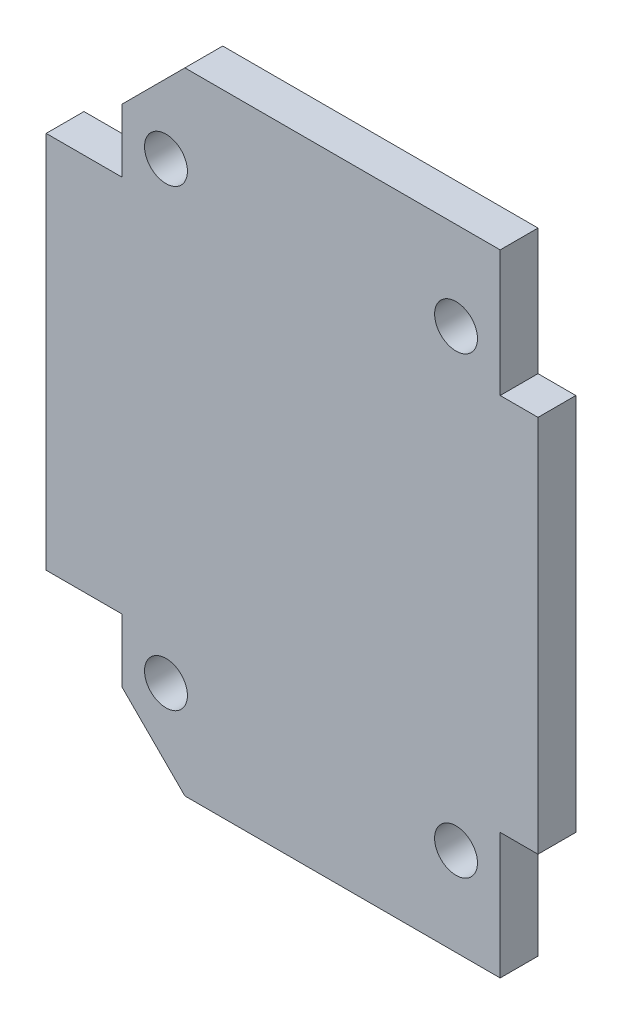
ISO-10303-21;
HEADER;
FILE_DESCRIPTION(('STEP AP214'),'2;1');
FILE_NAME('part.step','',(''),(''),'','','');
FILE_SCHEMA(('AUTOMOTIVE_DESIGN { 1 0 10303 214 1 1 1 1 }'));
ENDSEC;
DATA;
#1=APPLICATION_CONTEXT('core data for automotive mechanical design processes');
#2=APPLICATION_PROTOCOL_DEFINITION('international standard','automotive_design',2000,#1);
#3=PRODUCT_CONTEXT('',#1,'mechanical');
#4=PRODUCT('Part','Part','',(#3));
#5=PRODUCT_RELATED_PRODUCT_CATEGORY('part','',(#4));
#6=PRODUCT_DEFINITION_FORMATION('','',#4);
#7=PRODUCT_DEFINITION_CONTEXT('part definition',#1,'design');
#8=PRODUCT_DEFINITION('design','',#6,#7);
#9=PRODUCT_DEFINITION_SHAPE('','',#8);
#10=(LENGTH_UNIT() NAMED_UNIT(*) SI_UNIT(.MILLI.,.METRE.));
#11=(NAMED_UNIT(*) PLANE_ANGLE_UNIT() SI_UNIT($,.RADIAN.));
#12=(NAMED_UNIT(*) SI_UNIT($,.STERADIAN.) SOLID_ANGLE_UNIT());
#13=UNCERTAINTY_MEASURE_WITH_UNIT(LENGTH_MEASURE(1.E-05),#10,'distance_accuracy_value','');
#14=(GEOMETRIC_REPRESENTATION_CONTEXT(3) GLOBAL_UNCERTAINTY_ASSIGNED_CONTEXT((#13)) GLOBAL_UNIT_ASSIGNED_CONTEXT((#10,
#11,#12)) REPRESENTATION_CONTEXT('',''));
#15=CARTESIAN_POINT('',(0.,0.,0.));
#16=DIRECTION('',(0.,0.,1.));
#17=DIRECTION('',(1.,0.,0.));
#18=AXIS2_PLACEMENT_3D('',#15,#16,#17);
#19=CARTESIAN_POINT('',(0.,0.,3.));
#20=DIRECTION('',(0.,0.,-1.));
#21=DIRECTION('',(-1.,0.,0.));
#22=AXIS2_PLACEMENT_3D('',#19,#20,#21);
#23=PLANE('',#22);
#24=DIRECTION('',(0.,-1.,0.));
#25=VECTOR('',#24,1.);
#26=CARTESIAN_POINT('',(-15.,-25.,3.));
#27=LINE('',#26,#25);
#28=CARTESIAN_POINT('',(-15.,-15.,3.));
#29=VERTEX_POINT('',#28);
#30=CARTESIAN_POINT('',(-15.,-20.,3.));
#31=VERTEX_POINT('',#30);
#32=EDGE_CURVE('E285',#29,#31,#27,.T.);
#33=ORIENTED_EDGE('',*,*,#32,.T.);
#34=DIRECTION('',(-0.707106781186547,0.707106781186548,0.));
#35=VECTOR('',#34,1.);
#36=CARTESIAN_POINT('',(-9.99999999999999,-25.,3.));
#37=LINE('',#36,#35);
#38=CARTESIAN_POINT('',(-9.99999999999999,-25.,3.));
#39=VERTEX_POINT('',#38);
#40=EDGE_CURVE('E188',#31,#39,#37,.F.);
#41=ORIENTED_EDGE('',*,*,#40,.T.);
#42=DIRECTION('',(1.,0.,0.));
#43=VECTOR('',#42,1.);
#44=CARTESIAN_POINT('',(-15.,-25.,3.));
#45=LINE('',#44,#43);
#46=CARTESIAN_POINT('',(15.,-25.,3.));
#47=VERTEX_POINT('',#46);
#48=EDGE_CURVE('E288',#39,#47,#45,.T.);
#49=ORIENTED_EDGE('',*,*,#48,.T.);
#50=DIRECTION('',(0.,1.,0.));
#51=VECTOR('',#50,1.);
#52=CARTESIAN_POINT('',(15.,-25.,3.));
#53=LINE('',#52,#51);
#54=CARTESIAN_POINT('',(15.,-15.,3.));
#55=VERTEX_POINT('',#54);
#56=EDGE_CURVE('E293',#47,#55,#53,.T.);
#57=ORIENTED_EDGE('',*,*,#56,.T.);
#58=DIRECTION('',(1.,0.,0.));
#59=VECTOR('',#58,1.);
#60=CARTESIAN_POINT('',(15.,-15.,3.));
#61=LINE('',#60,#59);
#62=CARTESIAN_POINT('',(18.,-15.,3.));
#63=VERTEX_POINT('',#62);
#64=EDGE_CURVE('E300',#55,#63,#61,.T.);
#65=ORIENTED_EDGE('',*,*,#64,.T.);
#66=DIRECTION('',(0.,1.,0.));
#67=VECTOR('',#66,1.);
#68=CARTESIAN_POINT('',(18.,-15.,3.));
#69=LINE('',#68,#67);
#70=CARTESIAN_POINT('',(18.,15.,3.));
#71=VERTEX_POINT('',#70);
#72=EDGE_CURVE('E303',#63,#71,#69,.T.);
#73=ORIENTED_EDGE('',*,*,#72,.T.);
#74=DIRECTION('',(-1.,0.,0.));
#75=VECTOR('',#74,1.);
#76=CARTESIAN_POINT('',(15.,15.,3.));
#77=LINE('',#76,#75);
#78=CARTESIAN_POINT('',(15.,15.,3.));
#79=VERTEX_POINT('',#78);
#80=EDGE_CURVE('E154',#71,#79,#77,.T.);
#81=ORIENTED_EDGE('',*,*,#80,.T.);
#82=DIRECTION('',(0.,1.,0.));
#83=VECTOR('',#82,1.);
#84=CARTESIAN_POINT('',(15.,15.,3.));
#85=LINE('',#84,#83);
#86=CARTESIAN_POINT('',(15.,25.,3.));
#87=VERTEX_POINT('',#86);
#88=EDGE_CURVE('E148',#79,#87,#85,.T.);
#89=ORIENTED_EDGE('',*,*,#88,.T.);
#90=DIRECTION('',(-1.,0.,0.));
#91=VECTOR('',#90,1.);
#92=CARTESIAN_POINT('',(-15.,25.,3.));
#93=LINE('',#92,#91);
#94=CARTESIAN_POINT('',(-10.,25.,3.));
#95=VERTEX_POINT('',#94);
#96=EDGE_CURVE('E140',#87,#95,#93,.T.);
#97=ORIENTED_EDGE('',*,*,#96,.T.);
#98=DIRECTION('',(0.707106781186549,0.707106781186547,0.));
#99=VECTOR('',#98,1.);
#100=CARTESIAN_POINT('',(-15.,20.,3.));
#101=LINE('',#100,#99);
#102=CARTESIAN_POINT('',(-15.,20.,3.));
#103=VERTEX_POINT('',#102);
#104=EDGE_CURVE('E57',#95,#103,#101,.F.);
#105=ORIENTED_EDGE('',*,*,#104,.T.);
#106=DIRECTION('',(0.,-1.,0.));
#107=VECTOR('',#106,1.);
#108=CARTESIAN_POINT('',(-15.,15.,3.));
#109=LINE('',#108,#107);
#110=CARTESIAN_POINT('',(-15.,15.,3.));
#111=VERTEX_POINT('',#110);
#112=EDGE_CURVE('E147',#103,#111,#109,.T.);
#113=ORIENTED_EDGE('',*,*,#112,.T.);
#114=DIRECTION('',(-1.,0.,0.));
#115=VECTOR('',#114,1.);
#116=CARTESIAN_POINT('',(-15.,15.,3.));
#117=LINE('',#116,#115);
#118=CARTESIAN_POINT('',(-21.,15.,3.));
#119=VERTEX_POINT('',#118);
#120=EDGE_CURVE('E325',#111,#119,#117,.T.);
#121=ORIENTED_EDGE('',*,*,#120,.T.);
#122=DIRECTION('',(0.,-1.,0.));
#123=VECTOR('',#122,1.);
#124=CARTESIAN_POINT('',(-21.,-15.,3.));
#125=LINE('',#124,#123);
#126=CARTESIAN_POINT('',(-21.,-15.,3.));
#127=VERTEX_POINT('',#126);
#128=EDGE_CURVE('E272',#119,#127,#125,.T.);
#129=ORIENTED_EDGE('',*,*,#128,.T.);
#130=DIRECTION('',(1.,0.,0.));
#131=VECTOR('',#130,1.);
#132=CARTESIAN_POINT('',(-15.,-15.,3.));
#133=LINE('',#132,#131);
#134=EDGE_CURVE('E289',#127,#29,#133,.T.);
#135=ORIENTED_EDGE('',*,*,#134,.T.);
#136=EDGE_LOOP('',(#33,#41,#49,#57,#65,#73,#81,#89,#97,#105,#113,#121,#129,#135));
#137=FACE_BOUND('',#136,.T.);
#138=CARTESIAN_POINT('',(11.5,-18.,3.));
#139=DIRECTION('',(0.,0.,1.));
#140=DIRECTION('',(1.,0.,0.));
#141=AXIS2_PLACEMENT_3D('',#138,#139,#140);
#142=CIRCLE('',#141,1.7);
#143=CARTESIAN_POINT('',(13.2,-18.,3.));
#144=VERTEX_POINT('',#143);
#145=EDGE_CURVE('E308',#144,#144,#142,.T.);
#146=ORIENTED_EDGE('',*,*,#145,.F.);
#147=EDGE_LOOP('',(#146));
#148=FACE_BOUND('',#147,.T.);
#149=CARTESIAN_POINT('',(11.5,18.,3.));
#150=DIRECTION('',(0.,0.,1.));
#151=DIRECTION('',(1.,0.,0.));
#152=AXIS2_PLACEMENT_3D('',#149,#150,#151);
#153=CIRCLE('',#152,1.7);
#154=CARTESIAN_POINT('',(13.2,18.,3.));
#155=VERTEX_POINT('',#154);
#156=EDGE_CURVE('E317',#155,#155,#153,.T.);
#157=ORIENTED_EDGE('',*,*,#156,.F.);
#158=EDGE_LOOP('',(#157));
#159=FACE_BOUND('',#158,.T.);
#160=CARTESIAN_POINT('',(-11.5,18.,3.));
#161=DIRECTION('',(0.,0.,1.));
#162=DIRECTION('',(1.,0.,0.));
#163=AXIS2_PLACEMENT_3D('',#160,#161,#162);
#164=CIRCLE('',#163,1.7);
#165=CARTESIAN_POINT('',(-9.8,18.,3.));
#166=VERTEX_POINT('',#165);
#167=EDGE_CURVE('E534',#166,#166,#164,.T.);
#168=ORIENTED_EDGE('',*,*,#167,.F.);
#169=EDGE_LOOP('',(#168));
#170=FACE_BOUND('',#169,.T.);
#171=CARTESIAN_POINT('',(-11.5,-18.,3.));
#172=DIRECTION('',(0.,0.,1.));
#173=DIRECTION('',(1.,0.,0.));
#174=AXIS2_PLACEMENT_3D('',#171,#172,#173);
#175=CIRCLE('',#174,1.7);
#176=CARTESIAN_POINT('',(-9.8,-18.,3.));
#177=VERTEX_POINT('',#176);
#178=EDGE_CURVE('E523',#177,#177,#175,.T.);
#179=ORIENTED_EDGE('',*,*,#178,.F.);
#180=EDGE_LOOP('',(#179));
#181=FACE_BOUND('',#180,.T.);
#182=ADVANCED_FACE('F41',(#137,#148,#159,#170,#181),#23,.F.);
#183=CARTESIAN_POINT('',(0.,0.,0.));
#184=DIRECTION('',(0.,0.,-1.));
#185=DIRECTION('',(-1.,0.,0.));
#186=AXIS2_PLACEMENT_3D('',#183,#184,#185);
#187=PLANE('',#186);
#188=CARTESIAN_POINT('',(-11.5,18.,0.));
#189=DIRECTION('',(0.,0.,1.));
#190=DIRECTION('',(1.,0.,0.));
#191=AXIS2_PLACEMENT_3D('',#188,#189,#190);
#192=CIRCLE('',#191,1.7);
#193=CARTESIAN_POINT('',(-9.8,18.,0.));
#194=VERTEX_POINT('',#193);
#195=EDGE_CURVE('E531',#194,#194,#192,.T.);
#196=ORIENTED_EDGE('',*,*,#195,.T.);
#197=EDGE_LOOP('',(#196));
#198=FACE_BOUND('',#197,.T.);
#199=CARTESIAN_POINT('',(11.5,-18.,0.));
#200=DIRECTION('',(0.,0.,1.));
#201=DIRECTION('',(1.,0.,0.));
#202=AXIS2_PLACEMENT_3D('',#199,#200,#201);
#203=CIRCLE('',#202,1.7);
#204=CARTESIAN_POINT('',(13.2,-18.,0.));
#205=VERTEX_POINT('',#204);
#206=EDGE_CURVE('E311',#205,#205,#203,.T.);
#207=ORIENTED_EDGE('',*,*,#206,.T.);
#208=EDGE_LOOP('',(#207));
#209=FACE_BOUND('',#208,.T.);
#210=DIRECTION('',(1.,0.,0.));
#211=VECTOR('',#210,1.);
#212=CARTESIAN_POINT('',(-15.,-25.,0.));
#213=LINE('',#212,#211);
#214=CARTESIAN_POINT('',(-9.99999999999999,-25.,0.));
#215=VERTEX_POINT('',#214);
#216=CARTESIAN_POINT('',(15.,-25.,0.));
#217=VERTEX_POINT('',#216);
#218=EDGE_CURVE('E225',#215,#217,#213,.T.);
#219=ORIENTED_EDGE('',*,*,#218,.F.);
#220=DIRECTION('',(0.707106781186547,-0.707106781186548,0.));
#221=VECTOR('',#220,1.);
#222=CARTESIAN_POINT('',(-17.5,-17.5,0.));
#223=LINE('',#222,#221);
#224=CARTESIAN_POINT('',(-15.,-20.,0.));
#225=VERTEX_POINT('',#224);
#226=EDGE_CURVE('E180',#215,#225,#223,.F.);
#227=ORIENTED_EDGE('',*,*,#226,.T.);
#228=DIRECTION('',(0.,-1.,0.));
#229=VECTOR('',#228,1.);
#230=CARTESIAN_POINT('',(-15.,-25.,0.));
#231=LINE('',#230,#229);
#232=CARTESIAN_POINT('',(-15.,-15.,0.));
#233=VERTEX_POINT('',#232);
#234=EDGE_CURVE('E221',#233,#225,#231,.T.);
#235=ORIENTED_EDGE('',*,*,#234,.F.);
#236=DIRECTION('',(1.,0.,0.));
#237=VECTOR('',#236,1.);
#238=CARTESIAN_POINT('',(-15.,-15.,0.));
#239=LINE('',#238,#237);
#240=CARTESIAN_POINT('',(-21.,-15.,0.));
#241=VERTEX_POINT('',#240);
#242=EDGE_CURVE('E218',#241,#233,#239,.T.);
#243=ORIENTED_EDGE('',*,*,#242,.F.);
#244=DIRECTION('',(0.,-1.,0.));
#245=VECTOR('',#244,1.);
#246=CARTESIAN_POINT('',(-21.,-15.,0.));
#247=LINE('',#246,#245);
#248=CARTESIAN_POINT('',(-21.,15.,0.));
#249=VERTEX_POINT('',#248);
#250=EDGE_CURVE('E211',#249,#241,#247,.T.);
#251=ORIENTED_EDGE('',*,*,#250,.F.);
#252=DIRECTION('',(-1.,0.,0.));
#253=VECTOR('',#252,1.);
#254=CARTESIAN_POINT('',(-15.,15.,0.));
#255=LINE('',#254,#253);
#256=CARTESIAN_POINT('',(-15.,15.,0.));
#257=VERTEX_POINT('',#256);
#258=EDGE_CURVE('E205',#257,#249,#255,.T.);
#259=ORIENTED_EDGE('',*,*,#258,.F.);
#260=DIRECTION('',(0.,-1.,0.));
#261=VECTOR('',#260,1.);
#262=CARTESIAN_POINT('',(-15.,15.,0.));
#263=LINE('',#262,#261);
#264=CARTESIAN_POINT('',(-15.,20.,0.));
#265=VERTEX_POINT('',#264);
#266=EDGE_CURVE('E197',#265,#257,#263,.T.);
#267=ORIENTED_EDGE('',*,*,#266,.F.);
#268=DIRECTION('',(-0.707106781186549,-0.707106781186547,0.));
#269=VECTOR('',#268,1.);
#270=CARTESIAN_POINT('',(-17.5,17.5,0.));
#271=LINE('',#270,#269);
#272=CARTESIAN_POINT('',(-10.,25.,0.));
#273=VERTEX_POINT('',#272);
#274=EDGE_CURVE('E171',#265,#273,#271,.F.);
#275=ORIENTED_EDGE('',*,*,#274,.T.);
#276=DIRECTION('',(-1.,0.,0.));
#277=VECTOR('',#276,1.);
#278=CARTESIAN_POINT('',(-15.,25.,0.));
#279=LINE('',#278,#277);
#280=CARTESIAN_POINT('',(15.,25.,0.));
#281=VERTEX_POINT('',#280);
#282=EDGE_CURVE('E207',#281,#273,#279,.T.);
#283=ORIENTED_EDGE('',*,*,#282,.F.);
#284=DIRECTION('',(0.,1.,0.));
#285=VECTOR('',#284,1.);
#286=CARTESIAN_POINT('',(15.,15.,0.));
#287=LINE('',#286,#285);
#288=CARTESIAN_POINT('',(15.,15.,0.));
#289=VERTEX_POINT('',#288);
#290=EDGE_CURVE('E163',#289,#281,#287,.T.);
#291=ORIENTED_EDGE('',*,*,#290,.F.);
#292=DIRECTION('',(-1.,0.,0.));
#293=VECTOR('',#292,1.);
#294=CARTESIAN_POINT('',(15.,15.,0.));
#295=LINE('',#294,#293);
#296=CARTESIAN_POINT('',(18.,15.,0.));
#297=VERTEX_POINT('',#296);
#298=EDGE_CURVE('E159',#297,#289,#295,.T.);
#299=ORIENTED_EDGE('',*,*,#298,.F.);
#300=DIRECTION('',(0.,1.,0.));
#301=VECTOR('',#300,1.);
#302=CARTESIAN_POINT('',(18.,-15.,0.));
#303=LINE('',#302,#301);
#304=CARTESIAN_POINT('',(18.,-15.,0.));
#305=VERTEX_POINT('',#304);
#306=EDGE_CURVE('E234',#305,#297,#303,.T.);
#307=ORIENTED_EDGE('',*,*,#306,.F.);
#308=DIRECTION('',(1.,0.,0.));
#309=VECTOR('',#308,1.);
#310=CARTESIAN_POINT('',(15.,-15.,0.));
#311=LINE('',#310,#309);
#312=CARTESIAN_POINT('',(15.,-15.,0.));
#313=VERTEX_POINT('',#312);
#314=EDGE_CURVE('E231',#313,#305,#311,.T.);
#315=ORIENTED_EDGE('',*,*,#314,.F.);
#316=DIRECTION('',(0.,1.,0.));
#317=VECTOR('',#316,1.);
#318=CARTESIAN_POINT('',(15.,-25.,0.));
#319=LINE('',#318,#317);
#320=EDGE_CURVE('E228',#217,#313,#319,.T.);
#321=ORIENTED_EDGE('',*,*,#320,.F.);
#322=EDGE_LOOP('',(#219,#227,#235,#243,#251,#259,#267,#275,#283,#291,#299,#307,#315,#321));
#323=FACE_BOUND('',#322,.T.);
#324=CARTESIAN_POINT('',(11.5,18.,0.));
#325=DIRECTION('',(0.,0.,1.));
#326=DIRECTION('',(1.,0.,0.));
#327=AXIS2_PLACEMENT_3D('',#324,#325,#326);
#328=CIRCLE('',#327,1.7);
#329=CARTESIAN_POINT('',(13.2,18.,0.));
#330=VERTEX_POINT('',#329);
#331=EDGE_CURVE('E320',#330,#330,#328,.T.);
#332=ORIENTED_EDGE('',*,*,#331,.T.);
#333=EDGE_LOOP('',(#332));
#334=FACE_BOUND('',#333,.T.);
#335=CARTESIAN_POINT('',(-11.5,-18.,0.));
#336=DIRECTION('',(0.,0.,1.));
#337=DIRECTION('',(1.,0.,0.));
#338=AXIS2_PLACEMENT_3D('',#335,#336,#337);
#339=CIRCLE('',#338,1.7);
#340=CARTESIAN_POINT('',(-9.8,-18.,0.));
#341=VERTEX_POINT('',#340);
#342=EDGE_CURVE('E526',#341,#341,#339,.T.);
#343=ORIENTED_EDGE('',*,*,#342,.T.);
#344=EDGE_LOOP('',(#343));
#345=FACE_BOUND('',#344,.T.);
#346=ADVANCED_FACE('F202',(#198,#209,#323,#334,#345),#187,.T.);
#347=CARTESIAN_POINT('',(15.,15.,3.));
#348=DIRECTION('',(-1.,0.,0.));
#349=DIRECTION('',(0.,0.,1.));
#350=AXIS2_PLACEMENT_3D('',#347,#348,#349);
#351=PLANE('',#350);
#352=ORIENTED_EDGE('',*,*,#290,.T.);
#353=DIRECTION('',(0.,0.,-1.));
#354=VECTOR('',#353,1.);
#355=CARTESIAN_POINT('',(15.,25.,3.));
#356=LINE('',#355,#354);
#357=EDGE_CURVE('E144',#87,#281,#356,.T.);
#358=ORIENTED_EDGE('',*,*,#357,.F.);
#359=ORIENTED_EDGE('',*,*,#88,.F.);
#360=DIRECTION('',(0.,0.,-1.));
#361=VECTOR('',#360,1.);
#362=CARTESIAN_POINT('',(15.,15.,3.));
#363=LINE('',#362,#361);
#364=EDGE_CURVE('E239',#79,#289,#363,.T.);
#365=ORIENTED_EDGE('',*,*,#364,.T.);
#366=EDGE_LOOP('',(#352,#358,#359,#365));
#367=FACE_BOUND('',#366,.T.);
#368=ADVANCED_FACE('F161',(#367),#351,.F.);
#369=CARTESIAN_POINT('',(-15.,25.,3.));
#370=DIRECTION('',(0.,-1.,0.));
#371=DIRECTION('',(1.,0.,0.));
#372=AXIS2_PLACEMENT_3D('',#369,#370,#371);
#373=PLANE('',#372);
#374=ORIENTED_EDGE('',*,*,#282,.T.);
#375=DIRECTION('',(0.,0.,1.));
#376=VECTOR('',#375,1.);
#377=CARTESIAN_POINT('',(-10.,25.,3.));
#378=LINE('',#377,#376);
#379=EDGE_CURVE('E11',#273,#95,#378,.T.);
#380=ORIENTED_EDGE('',*,*,#379,.T.);
#381=ORIENTED_EDGE('',*,*,#96,.F.);
#382=ORIENTED_EDGE('',*,*,#357,.T.);
#383=EDGE_LOOP('',(#374,#380,#381,#382));
#384=FACE_BOUND('',#383,.T.);
#385=ADVANCED_FACE('F142',(#384),#373,.F.);
#386=CARTESIAN_POINT('',(-15.,15.,3.));
#387=DIRECTION('',(1.,0.,0.));
#388=DIRECTION('',(0.,1.,0.));
#389=AXIS2_PLACEMENT_3D('',#386,#387,#388);
#390=PLANE('',#389);
#391=ORIENTED_EDGE('',*,*,#112,.F.);
#392=DIRECTION('',(0.,0.,-1.));
#393=VECTOR('',#392,1.);
#394=CARTESIAN_POINT('',(-15.,20.,3.));
#395=LINE('',#394,#393);
#396=EDGE_CURVE('E50',#103,#265,#395,.T.);
#397=ORIENTED_EDGE('',*,*,#396,.T.);
#398=ORIENTED_EDGE('',*,*,#266,.T.);
#399=DIRECTION('',(0.,0.,-1.));
#400=VECTOR('',#399,1.);
#401=CARTESIAN_POINT('',(-15.,15.,3.));
#402=LINE('',#401,#400);
#403=EDGE_CURVE('E166',#111,#257,#402,.T.);
#404=ORIENTED_EDGE('',*,*,#403,.F.);
#405=EDGE_LOOP('',(#391,#397,#398,#404));
#406=FACE_BOUND('',#405,.T.);
#407=ADVANCED_FACE('F195',(#406),#390,.F.);
#408=CARTESIAN_POINT('',(-15.,15.,3.));
#409=DIRECTION('',(0.,-1.,0.));
#410=DIRECTION('',(1.,0.,0.));
#411=AXIS2_PLACEMENT_3D('',#408,#409,#410);
#412=PLANE('',#411);
#413=ORIENTED_EDGE('',*,*,#258,.T.);
#414=DIRECTION('',(0.,0.,-1.));
#415=VECTOR('',#414,1.);
#416=CARTESIAN_POINT('',(-21.,15.,3.));
#417=LINE('',#416,#415);
#418=EDGE_CURVE('E174',#119,#249,#417,.T.);
#419=ORIENTED_EDGE('',*,*,#418,.F.);
#420=ORIENTED_EDGE('',*,*,#120,.F.);
#421=ORIENTED_EDGE('',*,*,#403,.T.);
#422=EDGE_LOOP('',(#413,#419,#420,#421));
#423=FACE_BOUND('',#422,.T.);
#424=ADVANCED_FACE('F328',(#423),#412,.F.);
#425=CARTESIAN_POINT('',(-21.,-15.,3.));
#426=DIRECTION('',(1.,0.,0.));
#427=DIRECTION('',(0.,1.,0.));
#428=AXIS2_PLACEMENT_3D('',#425,#426,#427);
#429=PLANE('',#428);
#430=ORIENTED_EDGE('',*,*,#250,.T.);
#431=DIRECTION('',(0.,0.,-1.));
#432=VECTOR('',#431,1.);
#433=CARTESIAN_POINT('',(-21.,-15.,3.));
#434=LINE('',#433,#432);
#435=EDGE_CURVE('E262',#127,#241,#434,.T.);
#436=ORIENTED_EDGE('',*,*,#435,.F.);
#437=ORIENTED_EDGE('',*,*,#128,.F.);
#438=ORIENTED_EDGE('',*,*,#418,.T.);
#439=EDGE_LOOP('',(#430,#436,#437,#438));
#440=FACE_BOUND('',#439,.T.);
#441=ADVANCED_FACE('F270',(#440),#429,.F.);
#442=CARTESIAN_POINT('',(-15.,-15.,3.));
#443=DIRECTION('',(0.,1.,0.));
#444=DIRECTION('',(-1.,0.,0.));
#445=AXIS2_PLACEMENT_3D('',#442,#443,#444);
#446=PLANE('',#445);
#447=ORIENTED_EDGE('',*,*,#242,.T.);
#448=DIRECTION('',(0.,0.,-1.));
#449=VECTOR('',#448,1.);
#450=CARTESIAN_POINT('',(-15.,-15.,3.));
#451=LINE('',#450,#449);
#452=EDGE_CURVE('E258',#29,#233,#451,.T.);
#453=ORIENTED_EDGE('',*,*,#452,.F.);
#454=ORIENTED_EDGE('',*,*,#134,.F.);
#455=ORIENTED_EDGE('',*,*,#435,.T.);
#456=EDGE_LOOP('',(#447,#453,#454,#455));
#457=FACE_BOUND('',#456,.T.);
#458=ADVANCED_FACE('F279',(#457),#446,.F.);
#459=CARTESIAN_POINT('',(-15.,-25.,3.));
#460=DIRECTION('',(1.,0.,0.));
#461=DIRECTION('',(0.,0.,-1.));
#462=AXIS2_PLACEMENT_3D('',#459,#460,#461);
#463=PLANE('',#462);
#464=ORIENTED_EDGE('',*,*,#234,.T.);
#465=DIRECTION('',(0.,0.,1.));
#466=VECTOR('',#465,1.);
#467=CARTESIAN_POINT('',(-15.,-20.,3.));
#468=LINE('',#467,#466);
#469=EDGE_CURVE('E183',#225,#31,#468,.T.);
#470=ORIENTED_EDGE('',*,*,#469,.T.);
#471=ORIENTED_EDGE('',*,*,#32,.F.);
#472=ORIENTED_EDGE('',*,*,#452,.T.);
#473=EDGE_LOOP('',(#464,#470,#471,#472));
#474=FACE_BOUND('',#473,.T.);
#475=ADVANCED_FACE('F283',(#474),#463,.F.);
#476=CARTESIAN_POINT('',(-15.,-25.,3.));
#477=DIRECTION('',(0.,1.,0.));
#478=DIRECTION('',(-1.,0.,0.));
#479=AXIS2_PLACEMENT_3D('',#476,#477,#478);
#480=PLANE('',#479);
#481=ORIENTED_EDGE('',*,*,#48,.F.);
#482=DIRECTION('',(0.,0.,-1.));
#483=VECTOR('',#482,1.);
#484=CARTESIAN_POINT('',(-9.99999999999999,-25.,3.));
#485=LINE('',#484,#483);
#486=EDGE_CURVE('E165',#39,#215,#485,.T.);
#487=ORIENTED_EDGE('',*,*,#486,.T.);
#488=ORIENTED_EDGE('',*,*,#218,.T.);
#489=DIRECTION('',(0.,0.,-1.));
#490=VECTOR('',#489,1.);
#491=CARTESIAN_POINT('',(15.,-25.,3.));
#492=LINE('',#491,#490);
#493=EDGE_CURVE('E254',#47,#217,#492,.T.);
#494=ORIENTED_EDGE('',*,*,#493,.F.);
#495=EDGE_LOOP('',(#481,#487,#488,#494));
#496=FACE_BOUND('',#495,.T.);
#497=ADVANCED_FACE('F363',(#496),#480,.F.);
#498=CARTESIAN_POINT('',(15.,-25.,3.));
#499=DIRECTION('',(-1.,0.,0.));
#500=DIRECTION('',(0.,-1.,0.));
#501=AXIS2_PLACEMENT_3D('',#498,#499,#500);
#502=PLANE('',#501);
#503=ORIENTED_EDGE('',*,*,#320,.T.);
#504=DIRECTION('',(0.,0.,-1.));
#505=VECTOR('',#504,1.);
#506=CARTESIAN_POINT('',(15.,-15.,3.));
#507=LINE('',#506,#505);
#508=EDGE_CURVE('E250',#55,#313,#507,.T.);
#509=ORIENTED_EDGE('',*,*,#508,.F.);
#510=ORIENTED_EDGE('',*,*,#56,.F.);
#511=ORIENTED_EDGE('',*,*,#493,.T.);
#512=EDGE_LOOP('',(#503,#509,#510,#511));
#513=FACE_BOUND('',#512,.T.);
#514=ADVANCED_FACE('F359',(#513),#502,.F.);
#515=CARTESIAN_POINT('',(15.,-15.,3.));
#516=DIRECTION('',(0.,1.,0.));
#517=DIRECTION('',(0.,0.,1.));
#518=AXIS2_PLACEMENT_3D('',#515,#516,#517);
#519=PLANE('',#518);
#520=ORIENTED_EDGE('',*,*,#314,.T.);
#521=DIRECTION('',(0.,0.,-1.));
#522=VECTOR('',#521,1.);
#523=CARTESIAN_POINT('',(18.,-15.,3.));
#524=LINE('',#523,#522);
#525=EDGE_CURVE('E246',#63,#305,#524,.T.);
#526=ORIENTED_EDGE('',*,*,#525,.F.);
#527=ORIENTED_EDGE('',*,*,#64,.F.);
#528=ORIENTED_EDGE('',*,*,#508,.T.);
#529=EDGE_LOOP('',(#520,#526,#527,#528));
#530=FACE_BOUND('',#529,.T.);
#531=ADVANCED_FACE('F355',(#530),#519,.F.);
#532=CARTESIAN_POINT('',(18.,-15.,3.));
#533=DIRECTION('',(-1.,0.,0.));
#534=DIRECTION('',(0.,0.,1.));
#535=AXIS2_PLACEMENT_3D('',#532,#533,#534);
#536=PLANE('',#535);
#537=ORIENTED_EDGE('',*,*,#306,.T.);
#538=DIRECTION('',(0.,0.,-1.));
#539=VECTOR('',#538,1.);
#540=CARTESIAN_POINT('',(18.,15.,3.));
#541=LINE('',#540,#539);
#542=EDGE_CURVE('E242',#71,#297,#541,.T.);
#543=ORIENTED_EDGE('',*,*,#542,.F.);
#544=ORIENTED_EDGE('',*,*,#72,.F.);
#545=ORIENTED_EDGE('',*,*,#525,.T.);
#546=EDGE_LOOP('',(#537,#543,#544,#545));
#547=FACE_BOUND('',#546,.T.);
#548=ADVANCED_FACE('F351',(#547),#536,.F.);
#549=CARTESIAN_POINT('',(15.,15.,3.));
#550=DIRECTION('',(0.,-1.,0.));
#551=DIRECTION('',(1.,0.,0.));
#552=AXIS2_PLACEMENT_3D('',#549,#550,#551);
#553=PLANE('',#552);
#554=ORIENTED_EDGE('',*,*,#298,.T.);
#555=ORIENTED_EDGE('',*,*,#364,.F.);
#556=ORIENTED_EDGE('',*,*,#80,.F.);
#557=ORIENTED_EDGE('',*,*,#542,.T.);
#558=EDGE_LOOP('',(#554,#555,#556,#557));
#559=FACE_BOUND('',#558,.T.);
#560=ADVANCED_FACE('F348',(#559),#553,.F.);
#561=CARTESIAN_POINT('',(11.5,-18.,3.));
#562=DIRECTION('',(0.,0.,-1.));
#563=DIRECTION('',(-1.,0.,0.));
#564=AXIS2_PLACEMENT_3D('',#561,#562,#563);
#565=CYLINDRICAL_SURFACE('',#564,1.7);
#566=ORIENTED_EDGE('',*,*,#145,.T.);
#567=EDGE_LOOP('',(#566));
#568=FACE_BOUND('',#567,.T.);
#569=ORIENTED_EDGE('',*,*,#206,.F.);
#570=EDGE_LOOP('',(#569));
#571=FACE_BOUND('',#570,.T.);
#572=ADVANCED_FACE('F345',(#568,#571),#565,.F.);
#573=CARTESIAN_POINT('',(11.5,18.,3.));
#574=DIRECTION('',(0.,0.,-1.));
#575=DIRECTION('',(-1.,0.,0.));
#576=AXIS2_PLACEMENT_3D('',#573,#574,#575);
#577=CYLINDRICAL_SURFACE('',#576,1.7);
#578=ORIENTED_EDGE('',*,*,#156,.T.);
#579=EDGE_LOOP('',(#578));
#580=FACE_BOUND('',#579,.T.);
#581=ORIENTED_EDGE('',*,*,#331,.F.);
#582=EDGE_LOOP('',(#581));
#583=FACE_BOUND('',#582,.T.);
#584=ADVANCED_FACE('F407',(#580,#583),#577,.F.);
#585=CARTESIAN_POINT('',(-11.5,18.,3.));
#586=DIRECTION('',(0.,0.,-1.));
#587=DIRECTION('',(-1.,0.,0.));
#588=AXIS2_PLACEMENT_3D('',#585,#586,#587);
#589=CYLINDRICAL_SURFACE('',#588,1.7);
#590=ORIENTED_EDGE('',*,*,#167,.T.);
#591=EDGE_LOOP('',(#590));
#592=FACE_BOUND('',#591,.T.);
#593=ORIENTED_EDGE('',*,*,#195,.F.);
#594=EDGE_LOOP('',(#593));
#595=FACE_BOUND('',#594,.T.);
#596=ADVANCED_FACE('F413',(#592,#595),#589,.F.);
#597=CARTESIAN_POINT('',(-11.5,-18.,3.));
#598=DIRECTION('',(0.,0.,-1.));
#599=DIRECTION('',(-1.,0.,0.));
#600=AXIS2_PLACEMENT_3D('',#597,#598,#599);
#601=CYLINDRICAL_SURFACE('',#600,1.7);
#602=ORIENTED_EDGE('',*,*,#178,.T.);
#603=EDGE_LOOP('',(#602));
#604=FACE_BOUND('',#603,.T.);
#605=ORIENTED_EDGE('',*,*,#342,.F.);
#606=EDGE_LOOP('',(#605));
#607=FACE_BOUND('',#606,.T.);
#608=ADVANCED_FACE('F420',(#604,#607),#601,.F.);
#609=CARTESIAN_POINT('',(-9.99999999999999,-25.,3.));
#610=DIRECTION('',(0.707106781186548,0.707106781186547,0.));
#611=DIRECTION('',(0.,0.,-1.));
#612=AXIS2_PLACEMENT_3D('',#609,#610,#611);
#613=PLANE('',#612);
#614=ORIENTED_EDGE('',*,*,#40,.F.);
#615=ORIENTED_EDGE('',*,*,#469,.F.);
#616=ORIENTED_EDGE('',*,*,#226,.F.);
#617=ORIENTED_EDGE('',*,*,#486,.F.);
#618=EDGE_LOOP('',(#614,#615,#616,#617));
#619=FACE_BOUND('',#618,.T.);
#620=ADVANCED_FACE('F428',(#619),#613,.F.);
#621=CARTESIAN_POINT('',(-15.,20.,3.));
#622=DIRECTION('',(0.707106781186547,-0.707106781186549,0.));
#623=DIRECTION('',(0.,0.,-1.));
#624=AXIS2_PLACEMENT_3D('',#621,#622,#623);
#625=PLANE('',#624);
#626=ORIENTED_EDGE('',*,*,#104,.F.);
#627=ORIENTED_EDGE('',*,*,#379,.F.);
#628=ORIENTED_EDGE('',*,*,#274,.F.);
#629=ORIENTED_EDGE('',*,*,#396,.F.);
#630=EDGE_LOOP('',(#626,#627,#628,#629));
#631=FACE_BOUND('',#630,.T.);
#632=ADVANCED_FACE('F43',(#631),#625,.F.);
#633=CLOSED_SHELL('',(#182,#346,#368,#385,#407,#424,#441,#458,#475,#497,#514,#531,#548,#560,
#572,#584,#596,#608,#620,#632));
#634=MANIFOLD_SOLID_BREP('B2',#633);
#635=ADVANCED_BREP_SHAPE_REPRESENTATION('',(#18,#634),#14);
#636=SHAPE_DEFINITION_REPRESENTATION(#9,#635);
ENDSEC;
END-ISO-10303-21;
